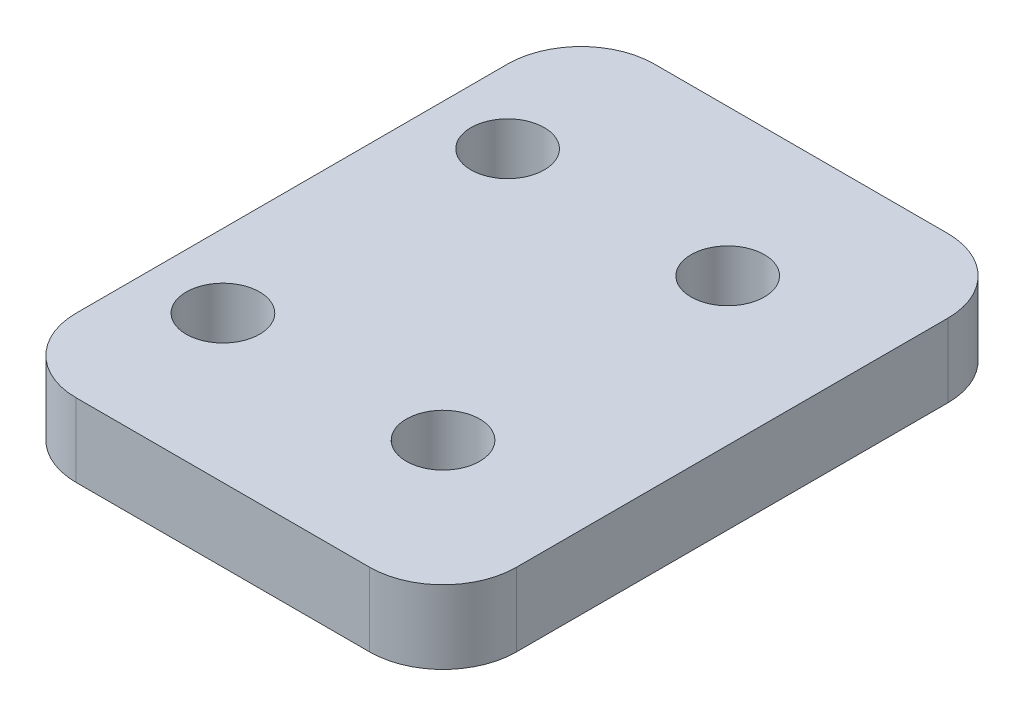
ISO-10303-21;
HEADER;
FILE_DESCRIPTION(('STEP AP214'),'2;1');
FILE_NAME('part.step','',(''),(''),'','','');
FILE_SCHEMA(('AUTOMOTIVE_DESIGN { 1 0 10303 214 1 1 1 1 }'));
ENDSEC;
DATA;
#1=APPLICATION_CONTEXT('core data for automotive mechanical design processes');
#2=APPLICATION_PROTOCOL_DEFINITION('international standard','automotive_design',2000,#1);
#3=PRODUCT_CONTEXT('',#1,'mechanical');
#4=PRODUCT('Part','Part','',(#3));
#5=PRODUCT_RELATED_PRODUCT_CATEGORY('part','',(#4));
#6=PRODUCT_DEFINITION_FORMATION('','',#4);
#7=PRODUCT_DEFINITION_CONTEXT('part definition',#1,'design');
#8=PRODUCT_DEFINITION('design','',#6,#7);
#9=PRODUCT_DEFINITION_SHAPE('','',#8);
#10=(LENGTH_UNIT() NAMED_UNIT(*) SI_UNIT(.MILLI.,.METRE.));
#11=(NAMED_UNIT(*) PLANE_ANGLE_UNIT() SI_UNIT($,.RADIAN.));
#12=(NAMED_UNIT(*) SI_UNIT($,.STERADIAN.) SOLID_ANGLE_UNIT());
#13=UNCERTAINTY_MEASURE_WITH_UNIT(LENGTH_MEASURE(1.E-05),#10,'distance_accuracy_value','');
#14=(GEOMETRIC_REPRESENTATION_CONTEXT(3) GLOBAL_UNCERTAINTY_ASSIGNED_CONTEXT((#13)) GLOBAL_UNIT_ASSIGNED_CONTEXT((#10,
#11,#12)) REPRESENTATION_CONTEXT('',''));
#15=CARTESIAN_POINT('',(0.,0.,0.));
#16=DIRECTION('',(0.,0.,1.));
#17=DIRECTION('',(1.,0.,0.));
#18=AXIS2_PLACEMENT_3D('',#15,#16,#17);
#19=CARTESIAN_POINT('',(0.,6.35,0.));
#20=DIRECTION('',(0.,-1.,0.));
#21=DIRECTION('',(0.,0.,-1.));
#22=AXIS2_PLACEMENT_3D('',#19,#20,#21);
#23=PLANE('',#22);
#24=DIRECTION('',(1.,0.,0.));
#25=VECTOR('',#24,1.);
#26=CARTESIAN_POINT('',(-19.05,6.35,25.019));
#27=LINE('',#26,#25);
#28=CARTESIAN_POINT('',(-12.7,6.35,25.019));
#29=VERTEX_POINT('',#28);
#30=CARTESIAN_POINT('',(12.7,6.35,25.019));
#31=VERTEX_POINT('',#30);
#32=EDGE_CURVE('E150',#29,#31,#27,.T.);
#33=ORIENTED_EDGE('',*,*,#32,.T.);
#34=CARTESIAN_POINT('',(12.7,6.35,18.669));
#35=DIRECTION('',(0.,-1.,0.));
#36=DIRECTION('',(0.,0.,-1.));
#37=AXIS2_PLACEMENT_3D('',#34,#35,#36);
#38=CIRCLE('',#37,6.35);
#39=CARTESIAN_POINT('',(19.05,6.35,18.669));
#40=VERTEX_POINT('',#39);
#41=EDGE_CURVE('E179',#31,#40,#38,.F.);
#42=ORIENTED_EDGE('',*,*,#41,.T.);
#43=DIRECTION('',(0.,0.,-1.));
#44=VECTOR('',#43,1.);
#45=CARTESIAN_POINT('',(19.05,6.35,25.019));
#46=LINE('',#45,#44);
#47=CARTESIAN_POINT('',(19.05,6.35,-18.669));
#48=VERTEX_POINT('',#47);
#49=EDGE_CURVE('E128',#40,#48,#46,.T.);
#50=ORIENTED_EDGE('',*,*,#49,.T.);
#51=CARTESIAN_POINT('',(12.7,6.35,-18.669));
#52=DIRECTION('',(0.,-1.,0.));
#53=DIRECTION('',(0.,0.,-1.));
#54=AXIS2_PLACEMENT_3D('',#51,#52,#53);
#55=CIRCLE('',#54,6.35);
#56=CARTESIAN_POINT('',(12.7,6.35,-25.019));
#57=VERTEX_POINT('',#56);
#58=EDGE_CURVE('E173',#48,#57,#55,.F.);
#59=ORIENTED_EDGE('',*,*,#58,.T.);
#60=DIRECTION('',(-1.,0.,0.));
#61=VECTOR('',#60,1.);
#62=CARTESIAN_POINT('',(-19.05,6.35,-25.019));
#63=LINE('',#62,#61);
#64=CARTESIAN_POINT('',(-12.7,6.35,-25.019));
#65=VERTEX_POINT('',#64);
#66=EDGE_CURVE('E192',#57,#65,#63,.T.);
#67=ORIENTED_EDGE('',*,*,#66,.T.);
#68=CARTESIAN_POINT('',(-12.7,6.35,-18.669));
#69=DIRECTION('',(0.,-1.,0.));
#70=DIRECTION('',(0.,0.,-1.));
#71=AXIS2_PLACEMENT_3D('',#68,#69,#70);
#72=CIRCLE('',#71,6.35);
#73=CARTESIAN_POINT('',(-19.05,6.35,-18.669));
#74=VERTEX_POINT('',#73);
#75=EDGE_CURVE('E62',#65,#74,#72,.F.);
#76=ORIENTED_EDGE('',*,*,#75,.T.);
#77=DIRECTION('',(0.,0.,1.));
#78=VECTOR('',#77,1.);
#79=CARTESIAN_POINT('',(-19.05,6.35,25.019));
#80=LINE('',#79,#78);
#81=CARTESIAN_POINT('',(-19.05,6.35,18.669));
#82=VERTEX_POINT('',#81);
#83=EDGE_CURVE('E199',#74,#82,#80,.T.);
#84=ORIENTED_EDGE('',*,*,#83,.T.);
#85=CARTESIAN_POINT('',(-12.7,6.35,18.669));
#86=DIRECTION('',(0.,-1.,0.));
#87=DIRECTION('',(0.,0.,-1.));
#88=AXIS2_PLACEMENT_3D('',#85,#86,#87);
#89=CIRCLE('',#88,6.35);
#90=EDGE_CURVE('E176',#82,#29,#89,.F.);
#91=ORIENTED_EDGE('',*,*,#90,.T.);
#92=EDGE_LOOP('',(#33,#42,#50,#59,#67,#76,#84,#91));
#93=FACE_BOUND('',#92,.T.);
#94=CARTESIAN_POINT('',(6.35,6.35,12.319));
#95=DIRECTION('',(0.,1.,0.));
#96=DIRECTION('',(0.,0.,1.));
#97=AXIS2_PLACEMENT_3D('',#94,#95,#96);
#98=CIRCLE('',#97,3.175);
#99=CARTESIAN_POINT('',(6.35,6.35,15.494));
#100=VERTEX_POINT('',#99);
#101=EDGE_CURVE('E139',#100,#100,#98,.T.);
#102=ORIENTED_EDGE('',*,*,#101,.F.);
#103=EDGE_LOOP('',(#102));
#104=FACE_BOUND('',#103,.T.);
#105=CARTESIAN_POINT('',(-12.7,6.35,12.319));
#106=DIRECTION('',(0.,1.,0.));
#107=DIRECTION('',(0.,0.,1.));
#108=AXIS2_PLACEMENT_3D('',#105,#106,#107);
#109=CIRCLE('',#108,3.175);
#110=CARTESIAN_POINT('',(-12.7,6.35,15.494));
#111=VERTEX_POINT('',#110);
#112=EDGE_CURVE('E218',#111,#111,#109,.T.);
#113=ORIENTED_EDGE('',*,*,#112,.F.);
#114=EDGE_LOOP('',(#113));
#115=FACE_BOUND('',#114,.T.);
#116=CARTESIAN_POINT('',(6.34999999999992,6.35,-12.319));
#117=DIRECTION('',(0.,1.,0.));
#118=DIRECTION('',(0.,0.,1.));
#119=AXIS2_PLACEMENT_3D('',#116,#117,#118);
#120=CIRCLE('',#119,3.175);
#121=CARTESIAN_POINT('',(6.34999999999992,6.35,-9.144));
#122=VERTEX_POINT('',#121);
#123=EDGE_CURVE('E224',#122,#122,#120,.T.);
#124=ORIENTED_EDGE('',*,*,#123,.F.);
#125=EDGE_LOOP('',(#124));
#126=FACE_BOUND('',#125,.T.);
#127=CARTESIAN_POINT('',(-12.7000000000001,6.35,-12.319));
#128=DIRECTION('',(0.,1.,0.));
#129=DIRECTION('',(0.,0.,1.));
#130=AXIS2_PLACEMENT_3D('',#127,#128,#129);
#131=CIRCLE('',#130,3.175);
#132=CARTESIAN_POINT('',(-12.7000000000001,6.35,-9.144));
#133=VERTEX_POINT('',#132);
#134=EDGE_CURVE('E232',#133,#133,#131,.T.);
#135=ORIENTED_EDGE('',*,*,#134,.F.);
#136=EDGE_LOOP('',(#135));
#137=FACE_BOUND('',#136,.T.);
#138=ADVANCED_FACE('F39',(#93,#104,#115,#126,#137),#23,.F.);
#139=CARTESIAN_POINT('',(0.,0.,0.));
#140=DIRECTION('',(0.,-1.,0.));
#141=DIRECTION('',(0.,0.,-1.));
#142=AXIS2_PLACEMENT_3D('',#139,#140,#141);
#143=PLANE('',#142);
#144=CARTESIAN_POINT('',(6.34999999999992,0.,-12.319));
#145=DIRECTION('',(0.,1.,0.));
#146=DIRECTION('',(0.,0.,1.));
#147=AXIS2_PLACEMENT_3D('',#144,#145,#146);
#148=CIRCLE('',#147,3.175);
#149=CARTESIAN_POINT('',(6.34999999999992,0.,-9.144));
#150=VERTEX_POINT('',#149);
#151=EDGE_CURVE('E228',#150,#150,#148,.T.);
#152=ORIENTED_EDGE('',*,*,#151,.T.);
#153=EDGE_LOOP('',(#152));
#154=FACE_BOUND('',#153,.T.);
#155=CARTESIAN_POINT('',(6.35,0.,12.319));
#156=DIRECTION('',(0.,1.,0.));
#157=DIRECTION('',(0.,0.,1.));
#158=AXIS2_PLACEMENT_3D('',#155,#156,#157);
#159=CIRCLE('',#158,3.175);
#160=CARTESIAN_POINT('',(6.35,0.,15.494));
#161=VERTEX_POINT('',#160);
#162=EDGE_CURVE('E147',#161,#161,#159,.T.);
#163=ORIENTED_EDGE('',*,*,#162,.T.);
#164=EDGE_LOOP('',(#163));
#165=FACE_BOUND('',#164,.T.);
#166=DIRECTION('',(0.,0.,-1.));
#167=VECTOR('',#166,1.);
#168=CARTESIAN_POINT('',(19.05,0.,25.019));
#169=LINE('',#168,#167);
#170=CARTESIAN_POINT('',(19.05,0.,18.669));
#171=VERTEX_POINT('',#170);
#172=CARTESIAN_POINT('',(19.05,0.,-18.669));
#173=VERTEX_POINT('',#172);
#174=EDGE_CURVE('E125',#171,#173,#169,.T.);
#175=ORIENTED_EDGE('',*,*,#174,.F.);
#176=CARTESIAN_POINT('',(12.7,0.,18.669));
#177=DIRECTION('',(0.,-1.,0.));
#178=DIRECTION('',(0.,0.,-1.));
#179=AXIS2_PLACEMENT_3D('',#176,#177,#178);
#180=CIRCLE('',#179,6.35);
#181=CARTESIAN_POINT('',(12.7,0.,25.019));
#182=VERTEX_POINT('',#181);
#183=EDGE_CURVE('E107',#171,#182,#180,.T.);
#184=ORIENTED_EDGE('',*,*,#183,.T.);
#185=DIRECTION('',(1.,0.,0.));
#186=VECTOR('',#185,1.);
#187=CARTESIAN_POINT('',(-19.05,0.,25.019));
#188=LINE('',#187,#186);
#189=CARTESIAN_POINT('',(-12.7,0.,25.019));
#190=VERTEX_POINT('',#189);
#191=EDGE_CURVE('E155',#190,#182,#188,.T.);
#192=ORIENTED_EDGE('',*,*,#191,.F.);
#193=CARTESIAN_POINT('',(-12.7,0.,18.669));
#194=DIRECTION('',(0.,-1.,0.));
#195=DIRECTION('',(0.,0.,-1.));
#196=AXIS2_PLACEMENT_3D('',#193,#194,#195);
#197=CIRCLE('',#196,6.35);
#198=CARTESIAN_POINT('',(-19.05,0.,18.669));
#199=VERTEX_POINT('',#198);
#200=EDGE_CURVE('E119',#190,#199,#197,.T.);
#201=ORIENTED_EDGE('',*,*,#200,.T.);
#202=DIRECTION('',(0.,0.,1.));
#203=VECTOR('',#202,1.);
#204=CARTESIAN_POINT('',(-19.05,0.,25.019));
#205=LINE('',#204,#203);
#206=CARTESIAN_POINT('',(-19.05,0.,-18.669));
#207=VERTEX_POINT('',#206);
#208=EDGE_CURVE('E144',#207,#199,#205,.T.);
#209=ORIENTED_EDGE('',*,*,#208,.F.);
#210=CARTESIAN_POINT('',(-12.7,0.,-18.669));
#211=DIRECTION('',(0.,-1.,0.));
#212=DIRECTION('',(0.,0.,-1.));
#213=AXIS2_PLACEMENT_3D('',#210,#211,#212);
#214=CIRCLE('',#213,6.35);
#215=CARTESIAN_POINT('',(-12.7,0.,-25.019));
#216=VERTEX_POINT('',#215);
#217=EDGE_CURVE('E130',#207,#216,#214,.T.);
#218=ORIENTED_EDGE('',*,*,#217,.T.);
#219=DIRECTION('',(-1.,0.,0.));
#220=VECTOR('',#219,1.);
#221=CARTESIAN_POINT('',(-19.05,0.,-25.019));
#222=LINE('',#221,#220);
#223=CARTESIAN_POINT('',(12.7,0.,-25.019));
#224=VERTEX_POINT('',#223);
#225=EDGE_CURVE('E138',#224,#216,#222,.T.);
#226=ORIENTED_EDGE('',*,*,#225,.F.);
#227=CARTESIAN_POINT('',(12.7,0.,-18.669));
#228=DIRECTION('',(0.,-1.,0.));
#229=DIRECTION('',(0.,0.,-1.));
#230=AXIS2_PLACEMENT_3D('',#227,#228,#229);
#231=CIRCLE('',#230,6.35);
#232=EDGE_CURVE('E136',#224,#173,#231,.T.);
#233=ORIENTED_EDGE('',*,*,#232,.T.);
#234=EDGE_LOOP('',(#175,#184,#192,#201,#209,#218,#226,#233));
#235=FACE_BOUND('',#234,.T.);
#236=CARTESIAN_POINT('',(-12.7,0.,12.319));
#237=DIRECTION('',(0.,1.,0.));
#238=DIRECTION('',(0.,0.,1.));
#239=AXIS2_PLACEMENT_3D('',#236,#237,#238);
#240=CIRCLE('',#239,3.175);
#241=CARTESIAN_POINT('',(-12.7,0.,15.494));
#242=VERTEX_POINT('',#241);
#243=EDGE_CURVE('E220',#242,#242,#240,.T.);
#244=ORIENTED_EDGE('',*,*,#243,.T.);
#245=EDGE_LOOP('',(#244));
#246=FACE_BOUND('',#245,.T.);
#247=CARTESIAN_POINT('',(-12.7000000000001,0.,-12.319));
#248=DIRECTION('',(0.,1.,0.));
#249=DIRECTION('',(0.,0.,1.));
#250=AXIS2_PLACEMENT_3D('',#247,#248,#249);
#251=CIRCLE('',#250,3.175);
#252=CARTESIAN_POINT('',(-12.7000000000001,0.,-9.144));
#253=VERTEX_POINT('',#252);
#254=EDGE_CURVE('E236',#253,#253,#251,.T.);
#255=ORIENTED_EDGE('',*,*,#254,.T.);
#256=EDGE_LOOP('',(#255));
#257=FACE_BOUND('',#256,.T.);
#258=ADVANCED_FACE('F133',(#154,#165,#235,#246,#257),#143,.T.);
#259=CARTESIAN_POINT('',(19.05,6.35,25.019));
#260=DIRECTION('',(-1.,0.,0.));
#261=DIRECTION('',(0.,0.,1.));
#262=AXIS2_PLACEMENT_3D('',#259,#260,#261);
#263=PLANE('',#262);
#264=ORIENTED_EDGE('',*,*,#49,.F.);
#265=DIRECTION('',(0.,-1.,0.));
#266=VECTOR('',#265,1.);
#267=CARTESIAN_POINT('',(19.05,6.35,18.669));
#268=LINE('',#267,#266);
#269=EDGE_CURVE('E111',#40,#171,#268,.T.);
#270=ORIENTED_EDGE('',*,*,#269,.T.);
#271=ORIENTED_EDGE('',*,*,#174,.T.);
#272=DIRECTION('',(0.,-1.,0.));
#273=VECTOR('',#272,1.);
#274=CARTESIAN_POINT('',(19.05,6.35,-18.669));
#275=LINE('',#274,#273);
#276=EDGE_CURVE('E131',#173,#48,#275,.F.);
#277=ORIENTED_EDGE('',*,*,#276,.T.);
#278=EDGE_LOOP('',(#264,#270,#271,#277));
#279=FACE_BOUND('',#278,.T.);
#280=ADVANCED_FACE('F124',(#279),#263,.F.);
#281=CARTESIAN_POINT('',(-19.05,6.35,-25.019));
#282=DIRECTION('',(0.,0.,1.));
#283=DIRECTION('',(1.,0.,0.));
#284=AXIS2_PLACEMENT_3D('',#281,#282,#283);
#285=PLANE('',#284);
#286=ORIENTED_EDGE('',*,*,#66,.F.);
#287=DIRECTION('',(0.,-1.,0.));
#288=VECTOR('',#287,1.);
#289=CARTESIAN_POINT('',(12.7,6.35,-25.019));
#290=LINE('',#289,#288);
#291=EDGE_CURVE('E11',#57,#224,#290,.T.);
#292=ORIENTED_EDGE('',*,*,#291,.T.);
#293=ORIENTED_EDGE('',*,*,#225,.T.);
#294=DIRECTION('',(0.,-1.,0.));
#295=VECTOR('',#294,1.);
#296=CARTESIAN_POINT('',(-12.7,6.35,-25.019));
#297=LINE('',#296,#295);
#298=EDGE_CURVE('E48',#216,#65,#297,.F.);
#299=ORIENTED_EDGE('',*,*,#298,.T.);
#300=EDGE_LOOP('',(#286,#292,#293,#299));
#301=FACE_BOUND('',#300,.T.);
#302=ADVANCED_FACE('F191',(#301),#285,.F.);
#303=CARTESIAN_POINT('',(-19.05,6.35,25.019));
#304=DIRECTION('',(1.,0.,0.));
#305=DIRECTION('',(0.,0.,-1.));
#306=AXIS2_PLACEMENT_3D('',#303,#304,#305);
#307=PLANE('',#306);
#308=ORIENTED_EDGE('',*,*,#208,.T.);
#309=DIRECTION('',(0.,-1.,0.));
#310=VECTOR('',#309,1.);
#311=CARTESIAN_POINT('',(-19.05,6.35,18.669));
#312=LINE('',#311,#310);
#313=EDGE_CURVE('E55',#199,#82,#312,.F.);
#314=ORIENTED_EDGE('',*,*,#313,.T.);
#315=ORIENTED_EDGE('',*,*,#83,.F.);
#316=DIRECTION('',(0.,-1.,0.));
#317=VECTOR('',#316,1.);
#318=CARTESIAN_POINT('',(-19.05,6.35,-18.669));
#319=LINE('',#318,#317);
#320=EDGE_CURVE('E182',#74,#207,#319,.T.);
#321=ORIENTED_EDGE('',*,*,#320,.T.);
#322=EDGE_LOOP('',(#308,#314,#315,#321));
#323=FACE_BOUND('',#322,.T.);
#324=ADVANCED_FACE('F203',(#323),#307,.F.);
#325=CARTESIAN_POINT('',(-19.05,6.35,25.019));
#326=DIRECTION('',(0.,0.,-1.));
#327=DIRECTION('',(-1.,0.,0.));
#328=AXIS2_PLACEMENT_3D('',#325,#326,#327);
#329=PLANE('',#328);
#330=ORIENTED_EDGE('',*,*,#191,.T.);
#331=DIRECTION('',(0.,-1.,0.));
#332=VECTOR('',#331,1.);
#333=CARTESIAN_POINT('',(12.7,6.35,25.019));
#334=LINE('',#333,#332);
#335=EDGE_CURVE('E112',#182,#31,#334,.F.);
#336=ORIENTED_EDGE('',*,*,#335,.T.);
#337=ORIENTED_EDGE('',*,*,#32,.F.);
#338=DIRECTION('',(0.,-1.,0.));
#339=VECTOR('',#338,1.);
#340=CARTESIAN_POINT('',(-12.7,6.35,25.019));
#341=LINE('',#340,#339);
#342=EDGE_CURVE('E118',#29,#190,#341,.T.);
#343=ORIENTED_EDGE('',*,*,#342,.T.);
#344=EDGE_LOOP('',(#330,#336,#337,#343));
#345=FACE_BOUND('',#344,.T.);
#346=ADVANCED_FACE('F210',(#345),#329,.F.);
#347=CARTESIAN_POINT('',(6.35,6.35,12.319));
#348=DIRECTION('',(0.,-1.,0.));
#349=DIRECTION('',(0.,0.,-1.));
#350=AXIS2_PLACEMENT_3D('',#347,#348,#349);
#351=CYLINDRICAL_SURFACE('',#350,3.175);
#352=ORIENTED_EDGE('',*,*,#101,.T.);
#353=EDGE_LOOP('',(#352));
#354=FACE_BOUND('',#353,.T.);
#355=ORIENTED_EDGE('',*,*,#162,.F.);
#356=EDGE_LOOP('',(#355));
#357=FACE_BOUND('',#356,.T.);
#358=ADVANCED_FACE('F255',(#354,#357),#351,.F.);
#359=CARTESIAN_POINT('',(-12.7,6.35,12.319));
#360=DIRECTION('',(0.,-1.,0.));
#361=DIRECTION('',(0.,0.,-1.));
#362=AXIS2_PLACEMENT_3D('',#359,#360,#361);
#363=CYLINDRICAL_SURFACE('',#362,3.175);
#364=ORIENTED_EDGE('',*,*,#112,.T.);
#365=EDGE_LOOP('',(#364));
#366=FACE_BOUND('',#365,.T.);
#367=ORIENTED_EDGE('',*,*,#243,.F.);
#368=EDGE_LOOP('',(#367));
#369=FACE_BOUND('',#368,.T.);
#370=ADVANCED_FACE('F347',(#366,#369),#363,.F.);
#371=CARTESIAN_POINT('',(6.34999999999992,6.35,-12.319));
#372=DIRECTION('',(0.,-1.,0.));
#373=DIRECTION('',(0.,0.,-1.));
#374=AXIS2_PLACEMENT_3D('',#371,#372,#373);
#375=CYLINDRICAL_SURFACE('',#374,3.175);
#376=ORIENTED_EDGE('',*,*,#123,.T.);
#377=EDGE_LOOP('',(#376));
#378=FACE_BOUND('',#377,.T.);
#379=ORIENTED_EDGE('',*,*,#151,.F.);
#380=EDGE_LOOP('',(#379));
#381=FACE_BOUND('',#380,.T.);
#382=ADVANCED_FACE('F338',(#378,#381),#375,.F.);
#383=CARTESIAN_POINT('',(-12.7000000000001,6.35,-12.319));
#384=DIRECTION('',(0.,-1.,0.));
#385=DIRECTION('',(0.,0.,-1.));
#386=AXIS2_PLACEMENT_3D('',#383,#384,#385);
#387=CYLINDRICAL_SURFACE('',#386,3.175);
#388=ORIENTED_EDGE('',*,*,#134,.T.);
#389=EDGE_LOOP('',(#388));
#390=FACE_BOUND('',#389,.T.);
#391=ORIENTED_EDGE('',*,*,#254,.F.);
#392=EDGE_LOOP('',(#391));
#393=FACE_BOUND('',#392,.T.);
#394=ADVANCED_FACE('F244',(#390,#393),#387,.F.);
#395=CARTESIAN_POINT('',(12.7,6.35,18.669));
#396=DIRECTION('',(0.,-1.,0.));
#397=DIRECTION('',(0.,0.,-1.));
#398=AXIS2_PLACEMENT_3D('',#395,#396,#397);
#399=CYLINDRICAL_SURFACE('',#398,6.35);
#400=ORIENTED_EDGE('',*,*,#41,.F.);
#401=ORIENTED_EDGE('',*,*,#335,.F.);
#402=ORIENTED_EDGE('',*,*,#183,.F.);
#403=ORIENTED_EDGE('',*,*,#269,.F.);
#404=EDGE_LOOP('',(#400,#401,#402,#403));
#405=FACE_BOUND('',#404,.T.);
#406=ADVANCED_FACE('F110',(#405),#399,.T.);
#407=CARTESIAN_POINT('',(-12.7,6.35,18.669));
#408=DIRECTION('',(0.,-1.,0.));
#409=DIRECTION('',(0.,0.,-1.));
#410=AXIS2_PLACEMENT_3D('',#407,#408,#409);
#411=CYLINDRICAL_SURFACE('',#410,6.35);
#412=ORIENTED_EDGE('',*,*,#90,.F.);
#413=ORIENTED_EDGE('',*,*,#313,.F.);
#414=ORIENTED_EDGE('',*,*,#200,.F.);
#415=ORIENTED_EDGE('',*,*,#342,.F.);
#416=EDGE_LOOP('',(#412,#413,#414,#415));
#417=FACE_BOUND('',#416,.T.);
#418=ADVANCED_FACE('F207',(#417),#411,.T.);
#419=CARTESIAN_POINT('',(12.7,6.35,-18.669));
#420=DIRECTION('',(0.,-1.,0.));
#421=DIRECTION('',(0.,0.,-1.));
#422=AXIS2_PLACEMENT_3D('',#419,#420,#421);
#423=CYLINDRICAL_SURFACE('',#422,6.35);
#424=ORIENTED_EDGE('',*,*,#58,.F.);
#425=ORIENTED_EDGE('',*,*,#276,.F.);
#426=ORIENTED_EDGE('',*,*,#232,.F.);
#427=ORIENTED_EDGE('',*,*,#291,.F.);
#428=EDGE_LOOP('',(#424,#425,#426,#427));
#429=FACE_BOUND('',#428,.T.);
#430=ADVANCED_FACE('F269',(#429),#423,.T.);
#431=CARTESIAN_POINT('',(-12.7,6.35,-18.669));
#432=DIRECTION('',(0.,-1.,0.));
#433=DIRECTION('',(0.,0.,-1.));
#434=AXIS2_PLACEMENT_3D('',#431,#432,#433);
#435=CYLINDRICAL_SURFACE('',#434,6.35);
#436=ORIENTED_EDGE('',*,*,#75,.F.);
#437=ORIENTED_EDGE('',*,*,#298,.F.);
#438=ORIENTED_EDGE('',*,*,#217,.F.);
#439=ORIENTED_EDGE('',*,*,#320,.F.);
#440=EDGE_LOOP('',(#436,#437,#438,#439));
#441=FACE_BOUND('',#440,.T.);
#442=ADVANCED_FACE('F41',(#441),#435,.T.);
#443=CLOSED_SHELL('',(#138,#258,#280,#302,#324,#346,#358,#370,#382,#394,#406,#418,#430,#442));
#444=MANIFOLD_SOLID_BREP('B2',#443);
#445=ADVANCED_BREP_SHAPE_REPRESENTATION('',(#18,#444),#14);
#446=SHAPE_DEFINITION_REPRESENTATION(#9,#445);
ENDSEC;
END-ISO-10303-21;
